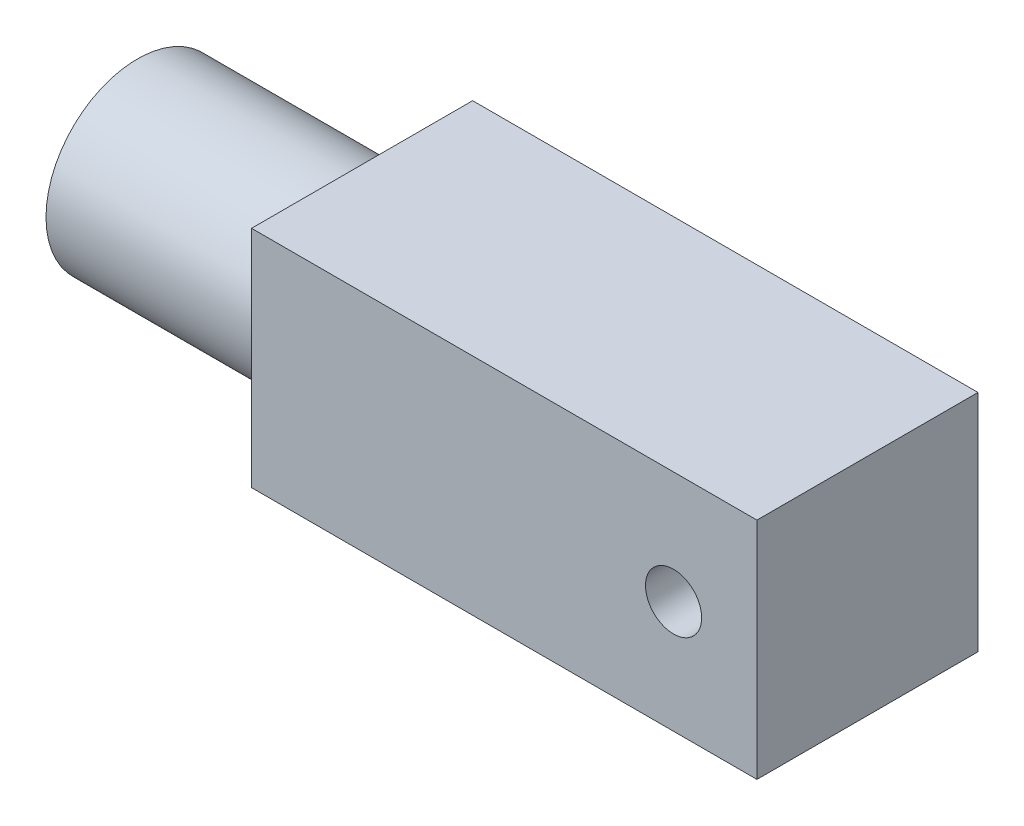
ISO-10303-21;
HEADER;
FILE_DESCRIPTION(('STEP AP214'),'2;1');
FILE_NAME('part.step','',(''),(''),'','','');
FILE_SCHEMA(('AUTOMOTIVE_DESIGN { 1 0 10303 214 1 1 1 1 }'));
ENDSEC;
DATA;
#1=APPLICATION_CONTEXT('core data for automotive mechanical design processes');
#2=APPLICATION_PROTOCOL_DEFINITION('international standard','automotive_design',2000,#1);
#3=PRODUCT_CONTEXT('',#1,'mechanical');
#4=PRODUCT('Part','Part','',(#3));
#5=PRODUCT_RELATED_PRODUCT_CATEGORY('part','',(#4));
#6=PRODUCT_DEFINITION_FORMATION('','',#4);
#7=PRODUCT_DEFINITION_CONTEXT('part definition',#1,'design');
#8=PRODUCT_DEFINITION('design','',#6,#7);
#9=PRODUCT_DEFINITION_SHAPE('','',#8);
#10=(LENGTH_UNIT() NAMED_UNIT(*) SI_UNIT(.MILLI.,.METRE.));
#11=(NAMED_UNIT(*) PLANE_ANGLE_UNIT() SI_UNIT($,.RADIAN.));
#12=(NAMED_UNIT(*) SI_UNIT($,.STERADIAN.) SOLID_ANGLE_UNIT());
#13=UNCERTAINTY_MEASURE_WITH_UNIT(LENGTH_MEASURE(1.E-05),#10,'distance_accuracy_value','');
#14=(GEOMETRIC_REPRESENTATION_CONTEXT(3) GLOBAL_UNCERTAINTY_ASSIGNED_CONTEXT((#13)) GLOBAL_UNIT_ASSIGNED_CONTEXT((#10,
#11,#12)) REPRESENTATION_CONTEXT('',''));
#15=CARTESIAN_POINT('',(0.,0.,0.));
#16=DIRECTION('',(0.,0.,1.));
#17=DIRECTION('',(1.,0.,0.));
#18=AXIS2_PLACEMENT_3D('',#15,#16,#17);
#19=CARTESIAN_POINT('',(-28.2487356321839,20.32,1.28520182432781));
#20=DIRECTION('',(1.,0.,0.));
#21=DIRECTION('',(0.,0.,-1.));
#22=AXIS2_PLACEMENT_3D('',#19,#20,#21);
#23=PLANE('',#22);
#24=CARTESIAN_POINT('',(-28.2487356321839,10.16,-8.71479817567219));
#25=DIRECTION('',(-1.,0.,0.));
#26=DIRECTION('',(0.,0.,1.));
#27=AXIS2_PLACEMENT_3D('',#24,#25,#26);
#28=CIRCLE('',#27,8.27614992696678);
#29=CARTESIAN_POINT('',(-28.2487356321839,10.16,-0.438648248705405));
#30=VERTEX_POINT('',#29);
#31=EDGE_CURVE('E11',#30,#30,#28,.T.);
#32=ORIENTED_EDGE('',*,*,#31,.F.);
#33=EDGE_LOOP('',(#32));
#34=FACE_BOUND('',#33,.T.);
#35=DIRECTION('',(0.,0.,1.));
#36=VECTOR('',#35,1.);
#37=CARTESIAN_POINT('',(-28.2487356321839,0.,1.28520182432781));
#38=LINE('',#37,#36);
#39=CARTESIAN_POINT('',(-28.2487356321839,0.,-18.7147981756722));
#40=VERTEX_POINT('',#39);
#41=CARTESIAN_POINT('',(-28.2487356321839,0.,1.28520182432781));
#42=VERTEX_POINT('',#41);
#43=EDGE_CURVE('E102',#40,#42,#38,.T.);
#44=ORIENTED_EDGE('',*,*,#43,.T.);
#45=DIRECTION('',(0.,-1.,0.));
#46=VECTOR('',#45,1.);
#47=CARTESIAN_POINT('',(-28.2487356321839,20.32,1.28520182432781));
#48=LINE('',#47,#46);
#49=CARTESIAN_POINT('',(-28.2487356321839,20.32,1.28520182432781));
#50=VERTEX_POINT('',#49);
#51=EDGE_CURVE('E39',#50,#42,#48,.T.);
#52=ORIENTED_EDGE('',*,*,#51,.F.);
#53=DIRECTION('',(0.,0.,1.));
#54=VECTOR('',#53,1.);
#55=CARTESIAN_POINT('',(-28.2487356321839,20.32,1.28520182432781));
#56=LINE('',#55,#54);
#57=CARTESIAN_POINT('',(-28.2487356321839,20.32,-18.7147981756722));
#58=VERTEX_POINT('',#57);
#59=EDGE_CURVE('E89',#58,#50,#56,.T.);
#60=ORIENTED_EDGE('',*,*,#59,.F.);
#61=DIRECTION('',(0.,-1.,0.));
#62=VECTOR('',#61,1.);
#63=CARTESIAN_POINT('',(-28.2487356321839,20.32,-18.7147981756722));
#64=LINE('',#63,#62);
#65=EDGE_CURVE('E98',#58,#40,#64,.T.);
#66=ORIENTED_EDGE('',*,*,#65,.T.);
#67=EDGE_LOOP('',(#44,#52,#60,#66));
#68=FACE_BOUND('',#67,.T.);
#69=ADVANCED_FACE('F36',(#34,#68),#23,.F.);
#70=CARTESIAN_POINT('',(-28.2487356321839,20.32,1.28520182432781));
#71=DIRECTION('',(0.,0.,-1.));
#72=DIRECTION('',(-1.,0.,0.));
#73=AXIS2_PLACEMENT_3D('',#70,#71,#72);
#74=PLANE('',#73);
#75=CARTESIAN_POINT('',(9.92871734398551,10.16,1.28520182432781));
#76=DIRECTION('',(0.,0.,1.));
#77=DIRECTION('',(1.,0.,0.));
#78=AXIS2_PLACEMENT_3D('',#75,#76,#77);
#79=CIRCLE('',#78,2.54);
#80=CARTESIAN_POINT('',(12.4687173439855,10.16,1.28520182432781));
#81=VERTEX_POINT('',#80);
#82=EDGE_CURVE('E119',#81,#81,#79,.T.);
#83=ORIENTED_EDGE('',*,*,#82,.F.);
#84=EDGE_LOOP('',(#83));
#85=FACE_BOUND('',#84,.T.);
#86=DIRECTION('',(1.,0.,0.));
#87=VECTOR('',#86,1.);
#88=CARTESIAN_POINT('',(-28.2487356321839,0.,1.28520182432781));
#89=LINE('',#88,#87);
#90=CARTESIAN_POINT('',(17.4712643678161,0.,1.28520182432781));
#91=VERTEX_POINT('',#90);
#92=EDGE_CURVE('E94',#42,#91,#89,.T.);
#93=ORIENTED_EDGE('',*,*,#92,.T.);
#94=DIRECTION('',(0.,-1.,0.));
#95=VECTOR('',#94,1.);
#96=CARTESIAN_POINT('',(17.4712643678161,20.32,1.28520182432781));
#97=LINE('',#96,#95);
#98=CARTESIAN_POINT('',(17.4712643678161,20.32,1.28520182432781));
#99=VERTEX_POINT('',#98);
#100=EDGE_CURVE('E92',#99,#91,#97,.T.);
#101=ORIENTED_EDGE('',*,*,#100,.F.);
#102=DIRECTION('',(1.,0.,0.));
#103=VECTOR('',#102,1.);
#104=CARTESIAN_POINT('',(-28.2487356321839,20.32,1.28520182432781));
#105=LINE('',#104,#103);
#106=EDGE_CURVE('E84',#50,#99,#105,.T.);
#107=ORIENTED_EDGE('',*,*,#106,.F.);
#108=ORIENTED_EDGE('',*,*,#51,.T.);
#109=EDGE_LOOP('',(#93,#101,#107,#108));
#110=FACE_BOUND('',#109,.T.);
#111=ADVANCED_FACE('F93',(#85,#110),#74,.F.);
#112=CARTESIAN_POINT('',(17.4712643678161,20.32,1.28520182432781));
#113=DIRECTION('',(-1.,0.,0.));
#114=DIRECTION('',(0.,0.,1.));
#115=AXIS2_PLACEMENT_3D('',#112,#113,#114);
#116=PLANE('',#115);
#117=DIRECTION('',(0.,0.,-1.));
#118=VECTOR('',#117,1.);
#119=CARTESIAN_POINT('',(17.4712643678161,0.,1.28520182432781));
#120=LINE('',#119,#118);
#121=CARTESIAN_POINT('',(17.4712643678161,0.,-18.7147981756722));
#122=VERTEX_POINT('',#121);
#123=EDGE_CURVE('E70',#91,#122,#120,.T.);
#124=ORIENTED_EDGE('',*,*,#123,.T.);
#125=DIRECTION('',(0.,-1.,0.));
#126=VECTOR('',#125,1.);
#127=CARTESIAN_POINT('',(17.4712643678161,20.32,-18.7147981756722));
#128=LINE('',#127,#126);
#129=CARTESIAN_POINT('',(17.4712643678161,20.32,-18.7147981756722));
#130=VERTEX_POINT('',#129);
#131=EDGE_CURVE('E95',#130,#122,#128,.T.);
#132=ORIENTED_EDGE('',*,*,#131,.F.);
#133=DIRECTION('',(0.,0.,-1.));
#134=VECTOR('',#133,1.);
#135=CARTESIAN_POINT('',(17.4712643678161,20.32,1.28520182432781));
#136=LINE('',#135,#134);
#137=EDGE_CURVE('E87',#99,#130,#136,.T.);
#138=ORIENTED_EDGE('',*,*,#137,.F.);
#139=ORIENTED_EDGE('',*,*,#100,.T.);
#140=EDGE_LOOP('',(#124,#132,#138,#139));
#141=FACE_BOUND('',#140,.T.);
#142=ADVANCED_FACE('F96',(#141),#116,.F.);
#143=CARTESIAN_POINT('',(-28.2487356321839,20.32,-18.7147981756722));
#144=DIRECTION('',(0.,0.,1.));
#145=DIRECTION('',(1.,0.,0.));
#146=AXIS2_PLACEMENT_3D('',#143,#144,#145);
#147=PLANE('',#146);
#148=DIRECTION('',(-1.,0.,0.));
#149=VECTOR('',#148,1.);
#150=CARTESIAN_POINT('',(-28.2487356321839,0.,-18.7147981756722));
#151=LINE('',#150,#149);
#152=EDGE_CURVE('E76',#122,#40,#151,.T.);
#153=ORIENTED_EDGE('',*,*,#152,.T.);
#154=ORIENTED_EDGE('',*,*,#65,.F.);
#155=DIRECTION('',(-1.,0.,0.));
#156=VECTOR('',#155,1.);
#157=CARTESIAN_POINT('',(-28.2487356321839,20.32,-18.7147981756722));
#158=LINE('',#157,#156);
#159=EDGE_CURVE('E53',#130,#58,#158,.T.);
#160=ORIENTED_EDGE('',*,*,#159,.F.);
#161=ORIENTED_EDGE('',*,*,#131,.T.);
#162=EDGE_LOOP('',(#153,#154,#160,#161));
#163=FACE_BOUND('',#162,.T.);
#164=ADVANCED_FACE('F110',(#163),#147,.F.);
#165=CARTESIAN_POINT('',(0.,20.32,0.));
#166=DIRECTION('',(0.,-1.,0.));
#167=DIRECTION('',(0.,0.,-1.));
#168=AXIS2_PLACEMENT_3D('',#165,#166,#167);
#169=PLANE('',#168);
#170=ORIENTED_EDGE('',*,*,#59,.T.);
#171=ORIENTED_EDGE('',*,*,#106,.T.);
#172=ORIENTED_EDGE('',*,*,#137,.T.);
#173=ORIENTED_EDGE('',*,*,#159,.T.);
#174=EDGE_LOOP('',(#170,#171,#172,#173));
#175=FACE_BOUND('',#174,.T.);
#176=ADVANCED_FACE('F85',(#175),#169,.F.);
#177=CARTESIAN_POINT('',(0.,0.,0.));
#178=DIRECTION('',(0.,-1.,0.));
#179=DIRECTION('',(0.,0.,-1.));
#180=AXIS2_PLACEMENT_3D('',#177,#178,#179);
#181=PLANE('',#180);
#182=ORIENTED_EDGE('',*,*,#43,.F.);
#183=ORIENTED_EDGE('',*,*,#152,.F.);
#184=ORIENTED_EDGE('',*,*,#123,.F.);
#185=ORIENTED_EDGE('',*,*,#92,.F.);
#186=EDGE_LOOP('',(#182,#183,#184,#185));
#187=FACE_BOUND('',#186,.T.);
#188=ADVANCED_FACE('F113',(#187),#181,.T.);
#189=CARTESIAN_POINT('',(-48.5687356321839,10.16,-8.71479817567219));
#190=DIRECTION('',(1.,0.,0.));
#191=DIRECTION('',(0.,0.,-1.));
#192=AXIS2_PLACEMENT_3D('',#189,#190,#191);
#193=CYLINDRICAL_SURFACE('',#192,8.27614992696678);
#194=CARTESIAN_POINT('',(-48.5687356321839,10.16,-8.71479817567219));
#195=DIRECTION('',(-1.,0.,0.));
#196=DIRECTION('',(0.,0.,1.));
#197=AXIS2_PLACEMENT_3D('',#194,#195,#196);
#198=CIRCLE('',#197,8.27614992696678);
#199=CARTESIAN_POINT('',(-48.5687356321839,10.16,-0.438648248705405));
#200=VERTEX_POINT('',#199);
#201=EDGE_CURVE('E105',#200,#200,#198,.T.);
#202=ORIENTED_EDGE('',*,*,#201,.F.);
#203=EDGE_LOOP('',(#202));
#204=FACE_BOUND('',#203,.T.);
#205=ORIENTED_EDGE('',*,*,#31,.T.);
#206=EDGE_LOOP('',(#205));
#207=FACE_BOUND('',#206,.T.);
#208=ADVANCED_FACE('F146',(#204,#207),#193,.T.);
#209=CARTESIAN_POINT('',(-48.5687356321839,10.16,-8.71479817567219));
#210=DIRECTION('',(-1.,0.,0.));
#211=DIRECTION('',(0.,0.,1.));
#212=AXIS2_PLACEMENT_3D('',#209,#210,#211);
#213=PLANE('',#212);
#214=ORIENTED_EDGE('',*,*,#201,.T.);
#215=EDGE_LOOP('',(#214));
#216=FACE_BOUND('',#215,.T.);
#217=ADVANCED_FACE('F130',(#216),#213,.T.);
#218=CARTESIAN_POINT('',(9.92871734398551,10.16,-17.7647981756722));
#219=DIRECTION('',(0.,0.,1.));
#220=DIRECTION('',(1.,0.,0.));
#221=AXIS2_PLACEMENT_3D('',#218,#219,#220);
#222=CYLINDRICAL_SURFACE('',#221,2.54);
#223=CARTESIAN_POINT('',(9.92871734398551,10.16,-17.7647981756722));
#224=DIRECTION('',(0.,0.,1.));
#225=DIRECTION('',(1.,0.,0.));
#226=AXIS2_PLACEMENT_3D('',#223,#224,#225);
#227=CIRCLE('',#226,2.54);
#228=CARTESIAN_POINT('',(12.4687173439855,10.16,-17.7647981756722));
#229=VERTEX_POINT('',#228);
#230=EDGE_CURVE('E118',#229,#229,#227,.T.);
#231=ORIENTED_EDGE('',*,*,#230,.F.);
#232=EDGE_LOOP('',(#231));
#233=FACE_BOUND('',#232,.T.);
#234=ORIENTED_EDGE('',*,*,#82,.T.);
#235=EDGE_LOOP('',(#234));
#236=FACE_BOUND('',#235,.T.);
#237=ADVANCED_FACE('F127',(#233,#236),#222,.F.);
#238=CARTESIAN_POINT('',(9.92871734398551,10.16,-17.7647981756722));
#239=DIRECTION('',(0.,0.,1.));
#240=DIRECTION('',(1.,0.,0.));
#241=AXIS2_PLACEMENT_3D('',#238,#239,#240);
#242=PLANE('',#241);
#243=ORIENTED_EDGE('',*,*,#230,.T.);
#244=EDGE_LOOP('',(#243));
#245=FACE_BOUND('',#244,.T.);
#246=ADVANCED_FACE('F125',(#245),#242,.T.);
#247=CLOSED_SHELL('',(#69,#111,#142,#164,#176,#188,#208,#217,#237,#246));
#248=MANIFOLD_SOLID_BREP('B2',#247);
#249=ADVANCED_BREP_SHAPE_REPRESENTATION('',(#18,#248),#14);
#250=SHAPE_DEFINITION_REPRESENTATION(#9,#249);
ENDSEC;
END-ISO-10303-21;
